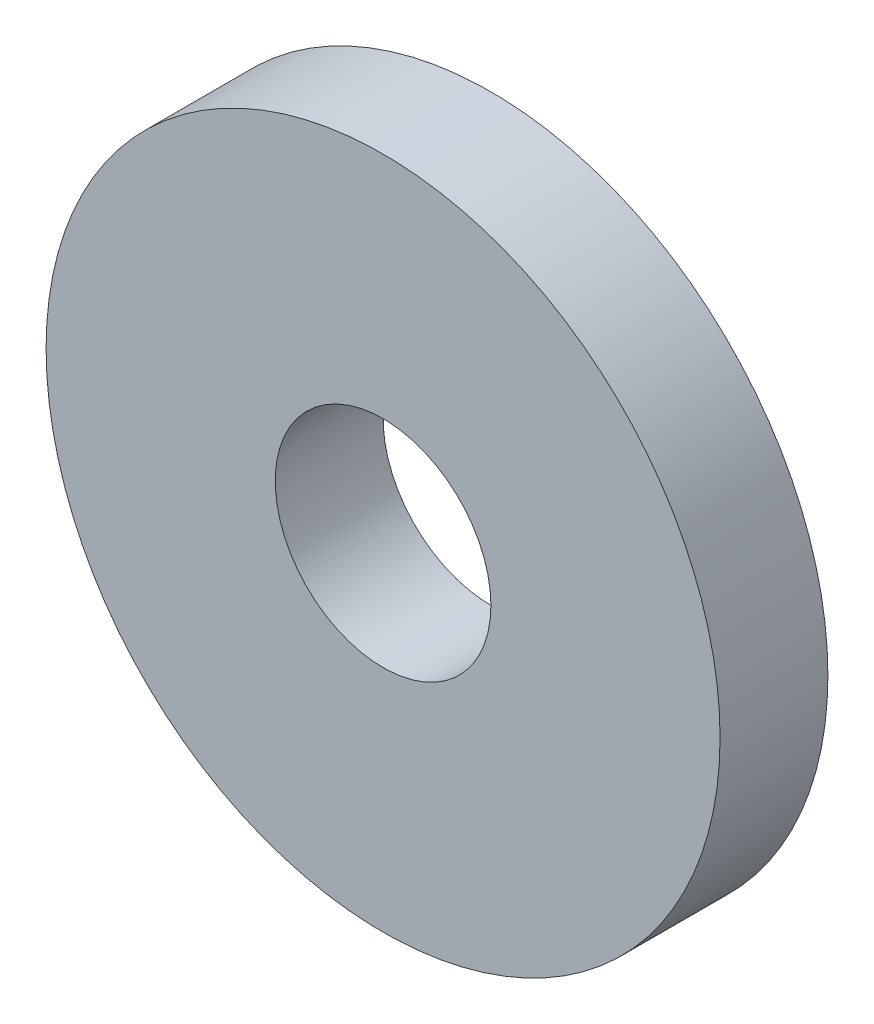
ISO-10303-21;
HEADER;
FILE_DESCRIPTION(('STEP AP214'),'2;1');
FILE_NAME('part.step','',(''),(''),'','','');
FILE_SCHEMA(('AUTOMOTIVE_DESIGN { 1 0 10303 214 1 1 1 1 }'));
ENDSEC;
DATA;
#1=APPLICATION_CONTEXT('core data for automotive mechanical design processes');
#2=APPLICATION_PROTOCOL_DEFINITION('international standard','automotive_design',2000,#1);
#3=PRODUCT_CONTEXT('',#1,'mechanical');
#4=PRODUCT('Part','Part','',(#3));
#5=PRODUCT_RELATED_PRODUCT_CATEGORY('part','',(#4));
#6=PRODUCT_DEFINITION_FORMATION('','',#4);
#7=PRODUCT_DEFINITION_CONTEXT('part definition',#1,'design');
#8=PRODUCT_DEFINITION('design','',#6,#7);
#9=PRODUCT_DEFINITION_SHAPE('','',#8);
#10=(LENGTH_UNIT() NAMED_UNIT(*) SI_UNIT(.MILLI.,.METRE.));
#11=(NAMED_UNIT(*) PLANE_ANGLE_UNIT() SI_UNIT($,.RADIAN.));
#12=(NAMED_UNIT(*) SI_UNIT($,.STERADIAN.) SOLID_ANGLE_UNIT());
#13=UNCERTAINTY_MEASURE_WITH_UNIT(LENGTH_MEASURE(1.E-05),#10,'distance_accuracy_value','');
#14=(GEOMETRIC_REPRESENTATION_CONTEXT(3) GLOBAL_UNCERTAINTY_ASSIGNED_CONTEXT((#13)) GLOBAL_UNIT_ASSIGNED_CONTEXT((#10,
#11,#12)) REPRESENTATION_CONTEXT('',''));
#15=CARTESIAN_POINT('',(0.,0.,0.));
#16=DIRECTION('',(0.,0.,1.));
#17=DIRECTION('',(1.,0.,0.));
#18=AXIS2_PLACEMENT_3D('',#15,#16,#17);
#19=CARTESIAN_POINT('',(0.,0.,4.));
#20=DIRECTION('',(0.,0.,1.));
#21=DIRECTION('',(1.,0.,0.));
#22=AXIS2_PLACEMENT_3D('',#19,#20,#21);
#23=PLANE('',#22);
#24=CARTESIAN_POINT('',(0.,0.,4.));
#25=DIRECTION('',(0.,0.,1.));
#26=DIRECTION('',(1.,0.,0.));
#27=AXIS2_PLACEMENT_3D('',#24,#25,#26);
#28=CIRCLE('',#27,12.5);
#29=CARTESIAN_POINT('',(12.5,0.,4.));
#30=VERTEX_POINT('',#29);
#31=EDGE_CURVE('E10',#30,#30,#28,.T.);
#32=ORIENTED_EDGE('',*,*,#31,.T.);
#33=EDGE_LOOP('',(#32));
#34=FACE_BOUND('',#33,.T.);
#35=CARTESIAN_POINT('',(0.,0.,4.));
#36=DIRECTION('',(0.,0.,1.));
#37=DIRECTION('',(1.,0.,0.));
#38=AXIS2_PLACEMENT_3D('',#35,#36,#37);
#39=CIRCLE('',#38,4.);
#40=CARTESIAN_POINT('',(4.,0.,4.));
#41=VERTEX_POINT('',#40);
#42=EDGE_CURVE('E50',#41,#41,#39,.T.);
#43=ORIENTED_EDGE('',*,*,#42,.F.);
#44=EDGE_LOOP('',(#43));
#45=FACE_BOUND('',#44,.T.);
#46=ADVANCED_FACE('F37',(#34,#45),#23,.T.);
#47=CARTESIAN_POINT('',(0.,0.,0.));
#48=DIRECTION('',(0.,0.,1.));
#49=DIRECTION('',(1.,0.,0.));
#50=AXIS2_PLACEMENT_3D('',#47,#48,#49);
#51=PLANE('',#50);
#52=CARTESIAN_POINT('',(0.,0.,0.));
#53=DIRECTION('',(0.,0.,1.));
#54=DIRECTION('',(1.,0.,0.));
#55=AXIS2_PLACEMENT_3D('',#52,#53,#54);
#56=CIRCLE('',#55,12.5);
#57=CARTESIAN_POINT('',(12.5,0.,0.));
#58=VERTEX_POINT('',#57);
#59=EDGE_CURVE('E41',#58,#58,#56,.T.);
#60=ORIENTED_EDGE('',*,*,#59,.F.);
#61=EDGE_LOOP('',(#60));
#62=FACE_BOUND('',#61,.T.);
#63=CARTESIAN_POINT('',(0.,0.,0.));
#64=DIRECTION('',(0.,0.,1.));
#65=DIRECTION('',(1.,0.,0.));
#66=AXIS2_PLACEMENT_3D('',#63,#64,#65);
#67=CIRCLE('',#66,4.);
#68=CARTESIAN_POINT('',(4.,0.,0.));
#69=VERTEX_POINT('',#68);
#70=EDGE_CURVE('E52',#69,#69,#67,.T.);
#71=ORIENTED_EDGE('',*,*,#70,.T.);
#72=EDGE_LOOP('',(#71));
#73=FACE_BOUND('',#72,.T.);
#74=ADVANCED_FACE('F64',(#62,#73),#51,.F.);
#75=CARTESIAN_POINT('',(0.,0.,4.));
#76=DIRECTION('',(0.,0.,-1.));
#77=DIRECTION('',(-1.,0.,0.));
#78=AXIS2_PLACEMENT_3D('',#75,#76,#77);
#79=CYLINDRICAL_SURFACE('',#78,12.5);
#80=ORIENTED_EDGE('',*,*,#31,.F.);
#81=EDGE_LOOP('',(#80));
#82=FACE_BOUND('',#81,.T.);
#83=ORIENTED_EDGE('',*,*,#59,.T.);
#84=EDGE_LOOP('',(#83));
#85=FACE_BOUND('',#84,.T.);
#86=ADVANCED_FACE('F39',(#82,#85),#79,.T.);
#87=CARTESIAN_POINT('',(0.,0.,4.));
#88=DIRECTION('',(0.,0.,-1.));
#89=DIRECTION('',(-1.,0.,0.));
#90=AXIS2_PLACEMENT_3D('',#87,#88,#89);
#91=CYLINDRICAL_SURFACE('',#90,4.);
#92=ORIENTED_EDGE('',*,*,#42,.T.);
#93=EDGE_LOOP('',(#92));
#94=FACE_BOUND('',#93,.T.);
#95=ORIENTED_EDGE('',*,*,#70,.F.);
#96=EDGE_LOOP('',(#95));
#97=FACE_BOUND('',#96,.T.);
#98=ADVANCED_FACE('F60',(#94,#97),#91,.F.);
#99=CLOSED_SHELL('',(#46,#74,#86,#98));
#100=MANIFOLD_SOLID_BREP('B2',#99);
#101=ADVANCED_BREP_SHAPE_REPRESENTATION('',(#18,#100),#14);
#102=SHAPE_DEFINITION_REPRESENTATION(#9,#101);
ENDSEC;
END-ISO-10303-21;
